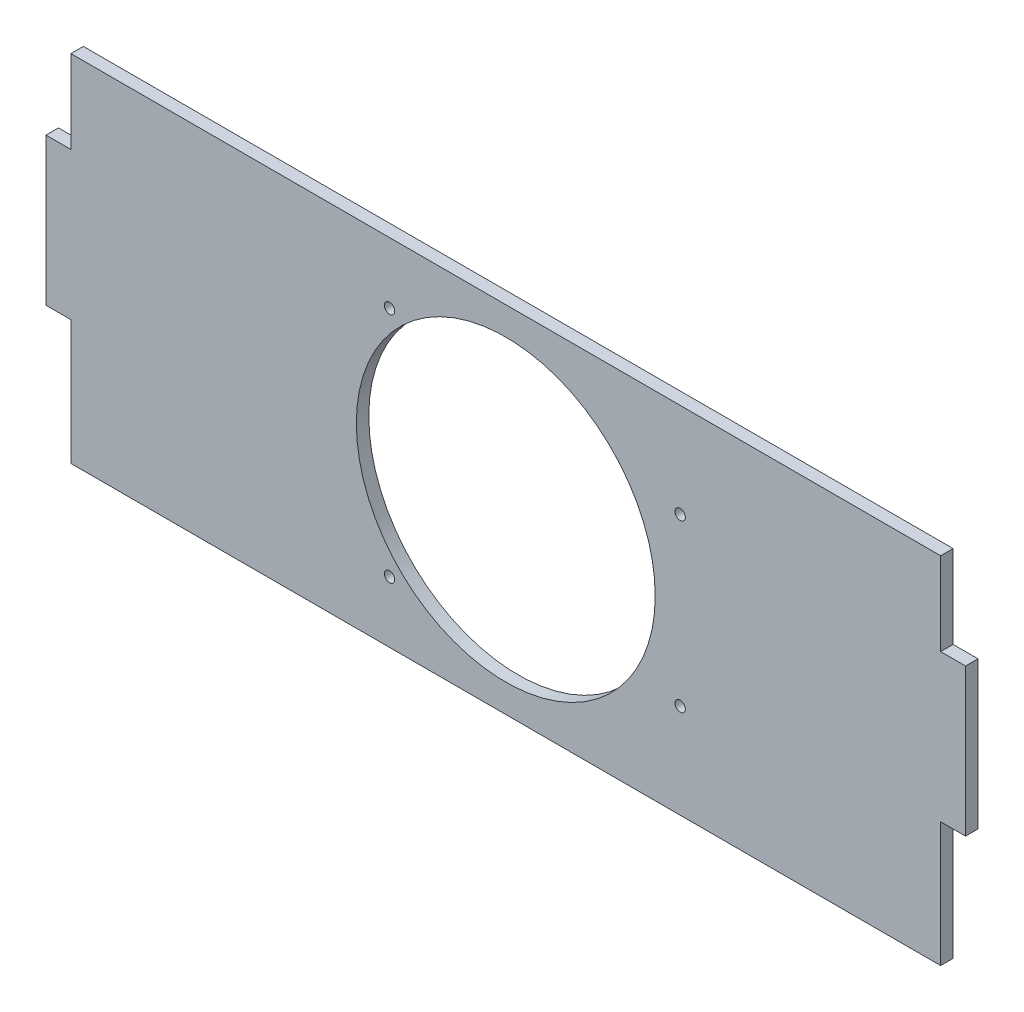
ISO-10303-21;
HEADER;
FILE_DESCRIPTION(('STEP AP214'),'2;1');
FILE_NAME('part.step','',(''),(''),'','','');
FILE_SCHEMA(('AUTOMOTIVE_DESIGN { 1 0 10303 214 1 1 1 1 }'));
ENDSEC;
DATA;
#1=APPLICATION_CONTEXT('core data for automotive mechanical design processes');
#2=APPLICATION_PROTOCOL_DEFINITION('international standard','automotive_design',2000,#1);
#3=PRODUCT_CONTEXT('',#1,'mechanical');
#4=PRODUCT('Part','Part','',(#3));
#5=PRODUCT_RELATED_PRODUCT_CATEGORY('part','',(#4));
#6=PRODUCT_DEFINITION_FORMATION('','',#4);
#7=PRODUCT_DEFINITION_CONTEXT('part definition',#1,'design');
#8=PRODUCT_DEFINITION('design','',#6,#7);
#9=PRODUCT_DEFINITION_SHAPE('','',#8);
#10=(LENGTH_UNIT() NAMED_UNIT(*) SI_UNIT(.MILLI.,.METRE.));
#11=(NAMED_UNIT(*) PLANE_ANGLE_UNIT() SI_UNIT($,.RADIAN.));
#12=(NAMED_UNIT(*) SI_UNIT($,.STERADIAN.) SOLID_ANGLE_UNIT());
#13=UNCERTAINTY_MEASURE_WITH_UNIT(LENGTH_MEASURE(1.E-05),#10,'distance_accuracy_value','');
#14=(GEOMETRIC_REPRESENTATION_CONTEXT(3) GLOBAL_UNCERTAINTY_ASSIGNED_CONTEXT((#13)) GLOBAL_UNIT_ASSIGNED_CONTEXT((#10,
#11,#12)) REPRESENTATION_CONTEXT('',''));
#15=CARTESIAN_POINT('',(0.,0.,0.));
#16=DIRECTION('',(0.,0.,1.));
#17=DIRECTION('',(1.,0.,0.));
#18=AXIS2_PLACEMENT_3D('',#15,#16,#17);
#19=CARTESIAN_POINT('',(6.,55.5,3.));
#20=DIRECTION('',(1.,0.,0.));
#21=DIRECTION('',(0.,1.,0.));
#22=AXIS2_PLACEMENT_3D('',#19,#20,#21);
#23=PLANE('',#22);
#24=DIRECTION('',(0.,-1.,0.));
#25=VECTOR('',#24,1.);
#26=CARTESIAN_POINT('',(6.,55.5,0.));
#27=LINE('',#26,#25);
#28=CARTESIAN_POINT('',(6.,55.5,0.));
#29=VERTEX_POINT('',#28);
#30=CARTESIAN_POINT('',(6.,35.5,0.));
#31=VERTEX_POINT('',#30);
#32=EDGE_CURVE('E157',#29,#31,#27,.T.);
#33=ORIENTED_EDGE('',*,*,#32,.T.);
#34=DIRECTION('',(0.,0.,-1.));
#35=VECTOR('',#34,1.);
#36=CARTESIAN_POINT('',(6.,35.5,3.));
#37=LINE('',#36,#35);
#38=CARTESIAN_POINT('',(6.,35.5,3.));
#39=VERTEX_POINT('',#38);
#40=EDGE_CURVE('E11',#39,#31,#37,.T.);
#41=ORIENTED_EDGE('',*,*,#40,.F.);
#42=DIRECTION('',(0.,-1.,0.));
#43=VECTOR('',#42,1.);
#44=CARTESIAN_POINT('',(6.,55.5,3.));
#45=LINE('',#44,#43);
#46=CARTESIAN_POINT('',(6.,55.5,3.));
#47=VERTEX_POINT('',#46);
#48=EDGE_CURVE('E180',#47,#39,#45,.T.);
#49=ORIENTED_EDGE('',*,*,#48,.F.);
#50=DIRECTION('',(0.,0.,-1.));
#51=VECTOR('',#50,1.);
#52=CARTESIAN_POINT('',(6.,55.5,3.));
#53=LINE('',#52,#51);
#54=EDGE_CURVE('E153',#47,#29,#53,.T.);
#55=ORIENTED_EDGE('',*,*,#54,.T.);
#56=EDGE_LOOP('',(#33,#41,#49,#55));
#57=FACE_BOUND('',#56,.T.);
#58=ADVANCED_FACE('F35',(#57),#23,.F.);
#59=CARTESIAN_POINT('',(0.,35.5,3.));
#60=DIRECTION('',(0.,-1.,0.));
#61=DIRECTION('',(0.,0.,-1.));
#62=AXIS2_PLACEMENT_3D('',#59,#60,#61);
#63=PLANE('',#62);
#64=DIRECTION('',(-1.,0.,0.));
#65=VECTOR('',#64,1.);
#66=CARTESIAN_POINT('',(0.,35.5,0.));
#67=LINE('',#66,#65);
#68=CARTESIAN_POINT('',(0.,35.5,0.));
#69=VERTEX_POINT('',#68);
#70=EDGE_CURVE('E160',#31,#69,#67,.T.);
#71=ORIENTED_EDGE('',*,*,#70,.T.);
#72=DIRECTION('',(0.,0.,-1.));
#73=VECTOR('',#72,1.);
#74=CARTESIAN_POINT('',(0.,35.5,3.));
#75=LINE('',#74,#73);
#76=CARTESIAN_POINT('',(0.,35.5,3.));
#77=VERTEX_POINT('',#76);
#78=EDGE_CURVE('E44',#77,#69,#75,.T.);
#79=ORIENTED_EDGE('',*,*,#78,.F.);
#80=DIRECTION('',(-1.,0.,0.));
#81=VECTOR('',#80,1.);
#82=CARTESIAN_POINT('',(0.,35.5,3.));
#83=LINE('',#82,#81);
#84=EDGE_CURVE('E108',#39,#77,#83,.T.);
#85=ORIENTED_EDGE('',*,*,#84,.F.);
#86=ORIENTED_EDGE('',*,*,#40,.T.);
#87=EDGE_LOOP('',(#71,#79,#85,#86));
#88=FACE_BOUND('',#87,.T.);
#89=ADVANCED_FACE('F274',(#88),#63,.F.);
#90=CARTESIAN_POINT('',(0.,0.,3.));
#91=DIRECTION('',(1.,0.,0.));
#92=DIRECTION('',(0.,0.,-1.));
#93=AXIS2_PLACEMENT_3D('',#90,#91,#92);
#94=PLANE('',#93);
#95=DIRECTION('',(0.,-1.,0.));
#96=VECTOR('',#95,1.);
#97=CARTESIAN_POINT('',(0.,0.,0.));
#98=LINE('',#97,#96);
#99=CARTESIAN_POINT('',(0.,0.,0.));
#100=VERTEX_POINT('',#99);
#101=EDGE_CURVE('E163',#69,#100,#98,.T.);
#102=ORIENTED_EDGE('',*,*,#101,.T.);
#103=DIRECTION('',(0.,0.,-1.));
#104=VECTOR('',#103,1.);
#105=CARTESIAN_POINT('',(0.,0.,3.));
#106=LINE('',#105,#104);
#107=CARTESIAN_POINT('',(0.,0.,3.));
#108=VERTEX_POINT('',#107);
#109=EDGE_CURVE('E199',#108,#100,#106,.T.);
#110=ORIENTED_EDGE('',*,*,#109,.F.);
#111=DIRECTION('',(0.,-1.,0.));
#112=VECTOR('',#111,1.);
#113=CARTESIAN_POINT('',(0.,0.,3.));
#114=LINE('',#113,#112);
#115=EDGE_CURVE('E234',#77,#108,#114,.T.);
#116=ORIENTED_EDGE('',*,*,#115,.F.);
#117=ORIENTED_EDGE('',*,*,#78,.T.);
#118=EDGE_LOOP('',(#102,#110,#116,#117));
#119=FACE_BOUND('',#118,.T.);
#120=ADVANCED_FACE('F278',(#119),#94,.F.);
#121=CARTESIAN_POINT('',(0.,0.,3.));
#122=DIRECTION('',(0.,1.,0.));
#123=DIRECTION('',(0.,0.,1.));
#124=AXIS2_PLACEMENT_3D('',#121,#122,#123);
#125=PLANE('',#124);
#126=DIRECTION('',(1.,0.,0.));
#127=VECTOR('',#126,1.);
#128=CARTESIAN_POINT('',(0.,0.,0.));
#129=LINE('',#128,#127);
#130=CARTESIAN_POINT('',(6.,0.,0.));
#131=VERTEX_POINT('',#130);
#132=EDGE_CURVE('E165',#100,#131,#129,.T.);
#133=ORIENTED_EDGE('',*,*,#132,.T.);
#134=DIRECTION('',(0.,0.,-1.));
#135=VECTOR('',#134,1.);
#136=CARTESIAN_POINT('',(6.,0.,3.));
#137=LINE('',#136,#135);
#138=CARTESIAN_POINT('',(6.,0.,3.));
#139=VERTEX_POINT('',#138);
#140=EDGE_CURVE('E196',#139,#131,#137,.T.);
#141=ORIENTED_EDGE('',*,*,#140,.F.);
#142=DIRECTION('',(1.,0.,0.));
#143=VECTOR('',#142,1.);
#144=CARTESIAN_POINT('',(0.,0.,3.));
#145=LINE('',#144,#143);
#146=EDGE_CURVE('E236',#108,#139,#145,.T.);
#147=ORIENTED_EDGE('',*,*,#146,.F.);
#148=ORIENTED_EDGE('',*,*,#109,.T.);
#149=EDGE_LOOP('',(#133,#141,#147,#148));
#150=FACE_BOUND('',#149,.T.);
#151=ADVANCED_FACE('F282',(#150),#125,.F.);
#152=CARTESIAN_POINT('',(6.,-30.,3.));
#153=DIRECTION('',(1.,0.,0.));
#154=DIRECTION('',(0.,0.,-1.));
#155=AXIS2_PLACEMENT_3D('',#152,#153,#154);
#156=PLANE('',#155);
#157=DIRECTION('',(0.,-1.,0.));
#158=VECTOR('',#157,1.);
#159=CARTESIAN_POINT('',(6.,-30.,0.));
#160=LINE('',#159,#158);
#161=CARTESIAN_POINT('',(6.,-30.,0.));
#162=VERTEX_POINT('',#161);
#163=EDGE_CURVE('E167',#131,#162,#160,.T.);
#164=ORIENTED_EDGE('',*,*,#163,.T.);
#165=DIRECTION('',(0.,0.,-1.));
#166=VECTOR('',#165,1.);
#167=CARTESIAN_POINT('',(6.,-30.,3.));
#168=LINE('',#167,#166);
#169=CARTESIAN_POINT('',(6.,-30.,3.));
#170=VERTEX_POINT('',#169);
#171=EDGE_CURVE('E193',#170,#162,#168,.T.);
#172=ORIENTED_EDGE('',*,*,#171,.F.);
#173=DIRECTION('',(0.,-1.,0.));
#174=VECTOR('',#173,1.);
#175=CARTESIAN_POINT('',(6.,-30.,3.));
#176=LINE('',#175,#174);
#177=EDGE_CURVE('E238',#139,#170,#176,.T.);
#178=ORIENTED_EDGE('',*,*,#177,.F.);
#179=ORIENTED_EDGE('',*,*,#140,.T.);
#180=EDGE_LOOP('',(#164,#172,#178,#179));
#181=FACE_BOUND('',#180,.T.);
#182=ADVANCED_FACE('F288',(#181),#156,.F.);
#183=CARTESIAN_POINT('',(6.,-30.,3.));
#184=DIRECTION('',(0.,1.,0.));
#185=DIRECTION('',(0.,0.,1.));
#186=AXIS2_PLACEMENT_3D('',#183,#184,#185);
#187=PLANE('',#186);
#188=DIRECTION('',(1.,0.,0.));
#189=VECTOR('',#188,1.);
#190=CARTESIAN_POINT('',(6.,-30.,0.));
#191=LINE('',#190,#189);
#192=CARTESIAN_POINT('',(215.5,-30.,0.));
#193=VERTEX_POINT('',#192);
#194=EDGE_CURVE('E169',#162,#193,#191,.T.);
#195=ORIENTED_EDGE('',*,*,#194,.T.);
#196=DIRECTION('',(0.,0.,-1.));
#197=VECTOR('',#196,1.);
#198=CARTESIAN_POINT('',(215.5,-30.,3.));
#199=LINE('',#198,#197);
#200=CARTESIAN_POINT('',(215.5,-30.,3.));
#201=VERTEX_POINT('',#200);
#202=EDGE_CURVE('E190',#201,#193,#199,.T.);
#203=ORIENTED_EDGE('',*,*,#202,.F.);
#204=DIRECTION('',(1.,0.,0.));
#205=VECTOR('',#204,1.);
#206=CARTESIAN_POINT('',(6.,-30.,3.));
#207=LINE('',#206,#205);
#208=EDGE_CURVE('E240',#170,#201,#207,.T.);
#209=ORIENTED_EDGE('',*,*,#208,.F.);
#210=ORIENTED_EDGE('',*,*,#171,.T.);
#211=EDGE_LOOP('',(#195,#203,#209,#210));
#212=FACE_BOUND('',#211,.T.);
#213=ADVANCED_FACE('F292',(#212),#187,.F.);
#214=CARTESIAN_POINT('',(215.5,-30.,3.));
#215=DIRECTION('',(-1.,0.,0.));
#216=DIRECTION('',(0.,0.,1.));
#217=AXIS2_PLACEMENT_3D('',#214,#215,#216);
#218=PLANE('',#217);
#219=DIRECTION('',(0.,1.,0.));
#220=VECTOR('',#219,1.);
#221=CARTESIAN_POINT('',(215.5,-30.,0.));
#222=LINE('',#221,#220);
#223=CARTESIAN_POINT('',(215.5,0.,0.));
#224=VERTEX_POINT('',#223);
#225=EDGE_CURVE('E171',#193,#224,#222,.T.);
#226=ORIENTED_EDGE('',*,*,#225,.T.);
#227=DIRECTION('',(0.,0.,-1.));
#228=VECTOR('',#227,1.);
#229=CARTESIAN_POINT('',(215.5,0.,3.));
#230=LINE('',#229,#228);
#231=CARTESIAN_POINT('',(215.5,0.,3.));
#232=VERTEX_POINT('',#231);
#233=EDGE_CURVE('E187',#232,#224,#230,.T.);
#234=ORIENTED_EDGE('',*,*,#233,.F.);
#235=DIRECTION('',(0.,1.,0.));
#236=VECTOR('',#235,1.);
#237=CARTESIAN_POINT('',(215.5,-30.,3.));
#238=LINE('',#237,#236);
#239=EDGE_CURVE('E242',#201,#232,#238,.T.);
#240=ORIENTED_EDGE('',*,*,#239,.F.);
#241=ORIENTED_EDGE('',*,*,#202,.T.);
#242=EDGE_LOOP('',(#226,#234,#240,#241));
#243=FACE_BOUND('',#242,.T.);
#244=ADVANCED_FACE('F296',(#243),#218,.F.);
#245=CARTESIAN_POINT('',(221.5,0.,3.));
#246=DIRECTION('',(0.,1.,0.));
#247=DIRECTION('',(-1.,0.,0.));
#248=AXIS2_PLACEMENT_3D('',#245,#246,#247);
#249=PLANE('',#248);
#250=DIRECTION('',(1.,0.,0.));
#251=VECTOR('',#250,1.);
#252=CARTESIAN_POINT('',(221.5,0.,0.));
#253=LINE('',#252,#251);
#254=CARTESIAN_POINT('',(221.5,0.,0.));
#255=VERTEX_POINT('',#254);
#256=EDGE_CURVE('E173',#224,#255,#253,.T.);
#257=ORIENTED_EDGE('',*,*,#256,.T.);
#258=DIRECTION('',(0.,0.,-1.));
#259=VECTOR('',#258,1.);
#260=CARTESIAN_POINT('',(221.5,0.,3.));
#261=LINE('',#260,#259);
#262=CARTESIAN_POINT('',(221.5,0.,3.));
#263=VERTEX_POINT('',#262);
#264=EDGE_CURVE('E184',#263,#255,#261,.T.);
#265=ORIENTED_EDGE('',*,*,#264,.F.);
#266=DIRECTION('',(1.,0.,0.));
#267=VECTOR('',#266,1.);
#268=CARTESIAN_POINT('',(221.5,0.,3.));
#269=LINE('',#268,#267);
#270=EDGE_CURVE('E244',#232,#263,#269,.T.);
#271=ORIENTED_EDGE('',*,*,#270,.F.);
#272=ORIENTED_EDGE('',*,*,#233,.T.);
#273=EDGE_LOOP('',(#257,#265,#271,#272));
#274=FACE_BOUND('',#273,.T.);
#275=ADVANCED_FACE('F250',(#274),#249,.F.);
#276=CARTESIAN_POINT('',(221.5,0.,3.));
#277=DIRECTION('',(-1.,0.,0.));
#278=DIRECTION('',(0.,0.,1.));
#279=AXIS2_PLACEMENT_3D('',#276,#277,#278);
#280=PLANE('',#279);
#281=DIRECTION('',(0.,1.,0.));
#282=VECTOR('',#281,1.);
#283=CARTESIAN_POINT('',(221.5,0.,0.));
#284=LINE('',#283,#282);
#285=CARTESIAN_POINT('',(221.5,35.5,0.));
#286=VERTEX_POINT('',#285);
#287=EDGE_CURVE('E175',#255,#286,#284,.T.);
#288=ORIENTED_EDGE('',*,*,#287,.T.);
#289=DIRECTION('',(0.,0.,-1.));
#290=VECTOR('',#289,1.);
#291=CARTESIAN_POINT('',(221.5,35.5,3.));
#292=LINE('',#291,#290);
#293=CARTESIAN_POINT('',(221.5,35.5,3.));
#294=VERTEX_POINT('',#293);
#295=EDGE_CURVE('E148',#294,#286,#292,.T.);
#296=ORIENTED_EDGE('',*,*,#295,.F.);
#297=DIRECTION('',(0.,1.,0.));
#298=VECTOR('',#297,1.);
#299=CARTESIAN_POINT('',(221.5,0.,3.));
#300=LINE('',#299,#298);
#301=EDGE_CURVE('E139',#263,#294,#300,.T.);
#302=ORIENTED_EDGE('',*,*,#301,.F.);
#303=ORIENTED_EDGE('',*,*,#264,.T.);
#304=EDGE_LOOP('',(#288,#296,#302,#303));
#305=FACE_BOUND('',#304,.T.);
#306=ADVANCED_FACE('F254',(#305),#280,.F.);
#307=CARTESIAN_POINT('',(221.5,35.5,3.));
#308=DIRECTION('',(0.,-1.,0.));
#309=DIRECTION('',(0.,0.,-1.));
#310=AXIS2_PLACEMENT_3D('',#307,#308,#309);
#311=PLANE('',#310);
#312=DIRECTION('',(-1.,0.,0.));
#313=VECTOR('',#312,1.);
#314=CARTESIAN_POINT('',(221.5,35.5,0.));
#315=LINE('',#314,#313);
#316=CARTESIAN_POINT('',(215.5,35.5,0.));
#317=VERTEX_POINT('',#316);
#318=EDGE_CURVE('E147',#286,#317,#315,.T.);
#319=ORIENTED_EDGE('',*,*,#318,.T.);
#320=DIRECTION('',(0.,0.,-1.));
#321=VECTOR('',#320,1.);
#322=CARTESIAN_POINT('',(215.5,35.5,3.));
#323=LINE('',#322,#321);
#324=CARTESIAN_POINT('',(215.5,35.5,3.));
#325=VERTEX_POINT('',#324);
#326=EDGE_CURVE('E144',#325,#317,#323,.T.);
#327=ORIENTED_EDGE('',*,*,#326,.F.);
#328=DIRECTION('',(-1.,0.,0.));
#329=VECTOR('',#328,1.);
#330=CARTESIAN_POINT('',(221.5,35.5,3.));
#331=LINE('',#330,#329);
#332=EDGE_CURVE('E133',#294,#325,#331,.T.);
#333=ORIENTED_EDGE('',*,*,#332,.F.);
#334=ORIENTED_EDGE('',*,*,#295,.T.);
#335=EDGE_LOOP('',(#319,#327,#333,#334));
#336=FACE_BOUND('',#335,.T.);
#337=ADVANCED_FACE('F145',(#336),#311,.F.);
#338=CARTESIAN_POINT('',(215.5,55.5,3.));
#339=DIRECTION('',(-1.,0.,0.));
#340=DIRECTION('',(0.,0.,1.));
#341=AXIS2_PLACEMENT_3D('',#338,#339,#340);
#342=PLANE('',#341);
#343=DIRECTION('',(0.,1.,0.));
#344=VECTOR('',#343,1.);
#345=CARTESIAN_POINT('',(215.5,55.5,0.));
#346=LINE('',#345,#344);
#347=CARTESIAN_POINT('',(215.5,55.5,0.));
#348=VERTEX_POINT('',#347);
#349=EDGE_CURVE('E94',#317,#348,#346,.T.);
#350=ORIENTED_EDGE('',*,*,#349,.T.);
#351=DIRECTION('',(0.,0.,-1.));
#352=VECTOR('',#351,1.);
#353=CARTESIAN_POINT('',(215.5,55.5,3.));
#354=LINE('',#353,#352);
#355=CARTESIAN_POINT('',(215.5,55.5,3.));
#356=VERTEX_POINT('',#355);
#357=EDGE_CURVE('E149',#356,#348,#354,.T.);
#358=ORIENTED_EDGE('',*,*,#357,.F.);
#359=DIRECTION('',(0.,1.,0.));
#360=VECTOR('',#359,1.);
#361=CARTESIAN_POINT('',(215.5,55.5,3.));
#362=LINE('',#361,#360);
#363=EDGE_CURVE('E137',#325,#356,#362,.T.);
#364=ORIENTED_EDGE('',*,*,#363,.F.);
#365=ORIENTED_EDGE('',*,*,#326,.T.);
#366=EDGE_LOOP('',(#350,#358,#364,#365));
#367=FACE_BOUND('',#366,.T.);
#368=ADVANCED_FACE('F151',(#367),#342,.F.);
#369=CARTESIAN_POINT('',(6.,55.5,3.));
#370=DIRECTION('',(0.,-1.,0.));
#371=DIRECTION('',(0.,0.,-1.));
#372=AXIS2_PLACEMENT_3D('',#369,#370,#371);
#373=PLANE('',#372);
#374=DIRECTION('',(-1.,0.,0.));
#375=VECTOR('',#374,1.);
#376=CARTESIAN_POINT('',(6.,55.5,0.));
#377=LINE('',#376,#375);
#378=EDGE_CURVE('E100',#348,#29,#377,.T.);
#379=ORIENTED_EDGE('',*,*,#378,.T.);
#380=ORIENTED_EDGE('',*,*,#54,.F.);
#381=DIRECTION('',(-1.,0.,0.));
#382=VECTOR('',#381,1.);
#383=CARTESIAN_POINT('',(6.,55.5,3.));
#384=LINE('',#383,#382);
#385=EDGE_CURVE('E53',#356,#47,#384,.T.);
#386=ORIENTED_EDGE('',*,*,#385,.F.);
#387=ORIENTED_EDGE('',*,*,#357,.T.);
#388=EDGE_LOOP('',(#379,#380,#386,#387));
#389=FACE_BOUND('',#388,.T.);
#390=ADVANCED_FACE('F262',(#389),#373,.F.);
#391=CARTESIAN_POINT('',(0.,0.,3.));
#392=DIRECTION('',(0.,0.,1.));
#393=DIRECTION('',(1.,0.,0.));
#394=AXIS2_PLACEMENT_3D('',#391,#392,#393);
#395=PLANE('',#394);
#396=CARTESIAN_POINT('',(82.7500000003876,40.7500000000046,3.));
#397=DIRECTION('',(0.,0.,1.));
#398=DIRECTION('',(1.,0.,0.));
#399=AXIS2_PLACEMENT_3D('',#396,#397,#398);
#400=CIRCLE('',#399,1.25);
#401=CARTESIAN_POINT('',(84.0000000003876,40.7500000000046,3.));
#402=VERTEX_POINT('',#401);
#403=EDGE_CURVE('E224',#402,#402,#400,.F.);
#404=ORIENTED_EDGE('',*,*,#403,.T.);
#405=EDGE_LOOP('',(#404));
#406=FACE_BOUND('',#405,.T.);
#407=CARTESIAN_POINT('',(82.7500000003873,-15.2499999999954,3.));
#408=DIRECTION('',(0.,0.,1.));
#409=DIRECTION('',(1.,0.,0.));
#410=AXIS2_PLACEMENT_3D('',#407,#408,#409);
#411=CIRCLE('',#410,1.25);
#412=CARTESIAN_POINT('',(84.0000000003873,-15.2499999999954,3.));
#413=VERTEX_POINT('',#412);
#414=EDGE_CURVE('E213',#413,#413,#411,.F.);
#415=ORIENTED_EDGE('',*,*,#414,.T.);
#416=EDGE_LOOP('',(#415));
#417=FACE_BOUND('',#416,.T.);
#418=CARTESIAN_POINT('',(152.750000000387,-7.24999999999568,3.));
#419=DIRECTION('',(0.,0.,1.));
#420=DIRECTION('',(1.,0.,0.));
#421=AXIS2_PLACEMENT_3D('',#418,#419,#420);
#422=CIRCLE('',#421,1.25);
#423=CARTESIAN_POINT('',(154.000000000387,-7.24999999999568,3.));
#424=VERTEX_POINT('',#423);
#425=EDGE_CURVE('E210',#424,#424,#422,.F.);
#426=ORIENTED_EDGE('',*,*,#425,.T.);
#427=EDGE_LOOP('',(#426));
#428=FACE_BOUND('',#427,.T.);
#429=CARTESIAN_POINT('',(152.749999999846,32.7500000000043,3.));
#430=DIRECTION('',(0.,0.,1.));
#431=DIRECTION('',(1.,0.,0.));
#432=AXIS2_PLACEMENT_3D('',#429,#430,#431);
#433=CIRCLE('',#432,1.25);
#434=CARTESIAN_POINT('',(153.999999999846,32.7500000000043,3.));
#435=VERTEX_POINT('',#434);
#436=EDGE_CURVE('E207',#435,#435,#433,.F.);
#437=ORIENTED_EDGE('',*,*,#436,.T.);
#438=EDGE_LOOP('',(#437));
#439=FACE_BOUND('',#438,.T.);
#440=CARTESIAN_POINT('',(110.75,12.75,3.));
#441=DIRECTION('',(0.,0.,1.));
#442=DIRECTION('',(1.,0.,0.));
#443=AXIS2_PLACEMENT_3D('',#440,#441,#442);
#444=CIRCLE('',#443,36.);
#445=CARTESIAN_POINT('',(146.75,12.75,3.));
#446=VERTEX_POINT('',#445);
#447=EDGE_CURVE('E227',#446,#446,#444,.T.);
#448=ORIENTED_EDGE('',*,*,#447,.F.);
#449=EDGE_LOOP('',(#448));
#450=FACE_BOUND('',#449,.T.);
#451=ORIENTED_EDGE('',*,*,#48,.T.);
#452=ORIENTED_EDGE('',*,*,#84,.T.);
#453=ORIENTED_EDGE('',*,*,#115,.T.);
#454=ORIENTED_EDGE('',*,*,#146,.T.);
#455=ORIENTED_EDGE('',*,*,#177,.T.);
#456=ORIENTED_EDGE('',*,*,#208,.T.);
#457=ORIENTED_EDGE('',*,*,#239,.T.);
#458=ORIENTED_EDGE('',*,*,#270,.T.);
#459=ORIENTED_EDGE('',*,*,#301,.T.);
#460=ORIENTED_EDGE('',*,*,#332,.T.);
#461=ORIENTED_EDGE('',*,*,#363,.T.);
#462=ORIENTED_EDGE('',*,*,#385,.T.);
#463=EDGE_LOOP('',(#451,#452,#453,#454,#455,#456,#457,#458,#459,#460,#461,#462));
#464=FACE_BOUND('',#463,.T.);
#465=ADVANCED_FACE('F135',(#406,#417,#428,#439,#450,#464),#395,.T.);
#466=CARTESIAN_POINT('',(0.,0.,0.));
#467=DIRECTION('',(0.,0.,1.));
#468=DIRECTION('',(1.,0.,0.));
#469=AXIS2_PLACEMENT_3D('',#466,#467,#468);
#470=PLANE('',#469);
#471=CARTESIAN_POINT('',(82.7500000003876,40.7500000000046,0.));
#472=DIRECTION('',(0.,0.,1.));
#473=DIRECTION('',(1.,0.,0.));
#474=AXIS2_PLACEMENT_3D('',#471,#472,#473);
#475=CIRCLE('',#474,1.25);
#476=CARTESIAN_POINT('',(84.0000000003876,40.7500000000046,0.));
#477=VERTEX_POINT('',#476);
#478=EDGE_CURVE('E38',#477,#477,#475,.F.);
#479=ORIENTED_EDGE('',*,*,#478,.F.);
#480=EDGE_LOOP('',(#479));
#481=FACE_BOUND('',#480,.T.);
#482=CARTESIAN_POINT('',(82.7500000003873,-15.2499999999954,0.));
#483=DIRECTION('',(0.,0.,1.));
#484=DIRECTION('',(1.,0.,0.));
#485=AXIS2_PLACEMENT_3D('',#482,#483,#484);
#486=CIRCLE('',#485,1.25);
#487=CARTESIAN_POINT('',(84.0000000003873,-15.2499999999954,0.));
#488=VERTEX_POINT('',#487);
#489=EDGE_CURVE('E211',#488,#488,#486,.F.);
#490=ORIENTED_EDGE('',*,*,#489,.F.);
#491=EDGE_LOOP('',(#490));
#492=FACE_BOUND('',#491,.T.);
#493=CARTESIAN_POINT('',(152.750000000387,-7.24999999999568,0.));
#494=DIRECTION('',(0.,0.,1.));
#495=DIRECTION('',(1.,0.,0.));
#496=AXIS2_PLACEMENT_3D('',#493,#494,#495);
#497=CIRCLE('',#496,1.25);
#498=CARTESIAN_POINT('',(154.000000000387,-7.24999999999568,0.));
#499=VERTEX_POINT('',#498);
#500=EDGE_CURVE('E208',#499,#499,#497,.F.);
#501=ORIENTED_EDGE('',*,*,#500,.F.);
#502=EDGE_LOOP('',(#501));
#503=FACE_BOUND('',#502,.T.);
#504=CARTESIAN_POINT('',(152.749999999846,32.7500000000043,0.));
#505=DIRECTION('',(0.,0.,1.));
#506=DIRECTION('',(1.,0.,0.));
#507=AXIS2_PLACEMENT_3D('',#504,#505,#506);
#508=CIRCLE('',#507,1.25);
#509=CARTESIAN_POINT('',(153.999999999846,32.7500000000043,0.));
#510=VERTEX_POINT('',#509);
#511=EDGE_CURVE('E204',#510,#510,#508,.F.);
#512=ORIENTED_EDGE('',*,*,#511,.F.);
#513=EDGE_LOOP('',(#512));
#514=FACE_BOUND('',#513,.T.);
#515=CARTESIAN_POINT('',(110.75,12.75,0.));
#516=DIRECTION('',(0.,0.,1.));
#517=DIRECTION('',(1.,0.,0.));
#518=AXIS2_PLACEMENT_3D('',#515,#516,#517);
#519=CIRCLE('',#518,36.);
#520=CARTESIAN_POINT('',(146.75,12.75,0.));
#521=VERTEX_POINT('',#520);
#522=EDGE_CURVE('E161',#521,#521,#519,.T.);
#523=ORIENTED_EDGE('',*,*,#522,.T.);
#524=EDGE_LOOP('',(#523));
#525=FACE_BOUND('',#524,.T.);
#526=ORIENTED_EDGE('',*,*,#32,.F.);
#527=ORIENTED_EDGE('',*,*,#378,.F.);
#528=ORIENTED_EDGE('',*,*,#349,.F.);
#529=ORIENTED_EDGE('',*,*,#318,.F.);
#530=ORIENTED_EDGE('',*,*,#287,.F.);
#531=ORIENTED_EDGE('',*,*,#256,.F.);
#532=ORIENTED_EDGE('',*,*,#225,.F.);
#533=ORIENTED_EDGE('',*,*,#194,.F.);
#534=ORIENTED_EDGE('',*,*,#163,.F.);
#535=ORIENTED_EDGE('',*,*,#132,.F.);
#536=ORIENTED_EDGE('',*,*,#101,.F.);
#537=ORIENTED_EDGE('',*,*,#70,.F.);
#538=EDGE_LOOP('',(#526,#527,#528,#529,#530,#531,#532,#533,#534,#535,#536,#537));
#539=FACE_BOUND('',#538,.T.);
#540=ADVANCED_FACE('F257',(#481,#492,#503,#514,#525,#539),#470,.F.);
#541=CARTESIAN_POINT('',(110.75,12.75,0.));
#542=DIRECTION('',(0.,0.,1.));
#543=DIRECTION('',(1.,0.,0.));
#544=AXIS2_PLACEMENT_3D('',#541,#542,#543);
#545=CYLINDRICAL_SURFACE('',#544,36.);
#546=ORIENTED_EDGE('',*,*,#522,.F.);
#547=EDGE_LOOP('',(#546));
#548=FACE_BOUND('',#547,.T.);
#549=ORIENTED_EDGE('',*,*,#447,.T.);
#550=EDGE_LOOP('',(#549));
#551=FACE_BOUND('',#550,.T.);
#552=ADVANCED_FACE('F324',(#548,#551),#545,.F.);
#553=CARTESIAN_POINT('',(152.749999999846,32.7500000000043,31.3313151595844));
#554=DIRECTION('',(0.,0.,-1.));
#555=DIRECTION('',(0.,1.,0.));
#556=AXIS2_PLACEMENT_3D('',#553,#554,#555);
#557=CYLINDRICAL_SURFACE('',#556,1.25);
#558=ORIENTED_EDGE('',*,*,#436,.F.);
#559=EDGE_LOOP('',(#558));
#560=FACE_BOUND('',#559,.T.);
#561=ORIENTED_EDGE('',*,*,#511,.T.);
#562=EDGE_LOOP('',(#561));
#563=FACE_BOUND('',#562,.T.);
#564=ADVANCED_FACE('F329',(#560,#563),#557,.F.);
#565=CARTESIAN_POINT('',(152.750000000387,-7.24999999999569,32.1417820141369));
#566=DIRECTION('',(0.,0.,-1.));
#567=DIRECTION('',(0.,1.,0.));
#568=AXIS2_PLACEMENT_3D('',#565,#566,#567);
#569=CYLINDRICAL_SURFACE('',#568,1.25);
#570=ORIENTED_EDGE('',*,*,#425,.F.);
#571=EDGE_LOOP('',(#570));
#572=FACE_BOUND('',#571,.T.);
#573=ORIENTED_EDGE('',*,*,#500,.T.);
#574=EDGE_LOOP('',(#573));
#575=FACE_BOUND('',#574,.T.);
#576=ADVANCED_FACE('F352',(#572,#575),#569,.F.);
#577=CARTESIAN_POINT('',(82.7500000003873,-15.2499999999954,32.9897707445655));
#578=DIRECTION('',(0.,0.,-1.));
#579=DIRECTION('',(0.,1.,0.));
#580=AXIS2_PLACEMENT_3D('',#577,#578,#579);
#581=CYLINDRICAL_SURFACE('',#580,1.25);
#582=ORIENTED_EDGE('',*,*,#414,.F.);
#583=EDGE_LOOP('',(#582));
#584=FACE_BOUND('',#583,.T.);
#585=ORIENTED_EDGE('',*,*,#489,.T.);
#586=EDGE_LOOP('',(#585));
#587=FACE_BOUND('',#586,.T.);
#588=ADVANCED_FACE('F362',(#584,#587),#581,.F.);
#589=CARTESIAN_POINT('',(82.7500000003876,40.7500000000046,30.8936736699541));
#590=DIRECTION('',(0.,0.,-1.));
#591=DIRECTION('',(0.,1.,0.));
#592=AXIS2_PLACEMENT_3D('',#589,#590,#591);
#593=CYLINDRICAL_SURFACE('',#592,1.25);
#594=ORIENTED_EDGE('',*,*,#403,.F.);
#595=EDGE_LOOP('',(#594));
#596=FACE_BOUND('',#595,.T.);
#597=ORIENTED_EDGE('',*,*,#478,.T.);
#598=EDGE_LOOP('',(#597));
#599=FACE_BOUND('',#598,.T.);
#600=ADVANCED_FACE('F372',(#596,#599),#593,.F.);
#601=CLOSED_SHELL('',(#58,#89,#120,#151,#182,#213,#244,#275,#306,#337,#368,#390,#465,#540,#552,
#564,#576,#588,#600));
#602=MANIFOLD_SOLID_BREP('B2',#601);
#603=ADVANCED_BREP_SHAPE_REPRESENTATION('',(#18,#602),#14);
#604=SHAPE_DEFINITION_REPRESENTATION(#9,#603);
ENDSEC;
END-ISO-10303-21;
